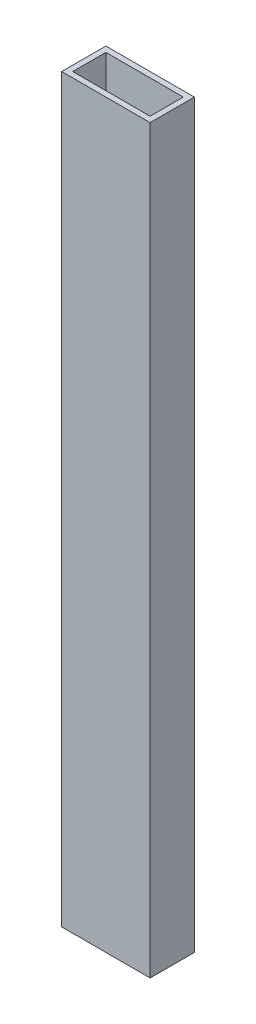
ISO-10303-21;
HEADER;
FILE_DESCRIPTION(('STEP AP214'),'2;1');
FILE_NAME('part.step','',(''),(''),'','','');
FILE_SCHEMA(('AUTOMOTIVE_DESIGN { 1 0 10303 214 1 1 1 1 }'));
ENDSEC;
DATA;
#1=APPLICATION_CONTEXT('core data for automotive mechanical design processes');
#2=APPLICATION_PROTOCOL_DEFINITION('international standard','automotive_design',2000,#1);
#3=PRODUCT_CONTEXT('',#1,'mechanical');
#4=PRODUCT('Part','Part','',(#3));
#5=PRODUCT_RELATED_PRODUCT_CATEGORY('part','',(#4));
#6=PRODUCT_DEFINITION_FORMATION('','',#4);
#7=PRODUCT_DEFINITION_CONTEXT('part definition',#1,'design');
#8=PRODUCT_DEFINITION('design','',#6,#7);
#9=PRODUCT_DEFINITION_SHAPE('','',#8);
#10=(LENGTH_UNIT() NAMED_UNIT(*) SI_UNIT(.MILLI.,.METRE.));
#11=(NAMED_UNIT(*) PLANE_ANGLE_UNIT() SI_UNIT($,.RADIAN.));
#12=(NAMED_UNIT(*) SI_UNIT($,.STERADIAN.) SOLID_ANGLE_UNIT());
#13=UNCERTAINTY_MEASURE_WITH_UNIT(LENGTH_MEASURE(1.E-05),#10,'distance_accuracy_value','');
#14=(GEOMETRIC_REPRESENTATION_CONTEXT(3) GLOBAL_UNCERTAINTY_ASSIGNED_CONTEXT((#13)) GLOBAL_UNIT_ASSIGNED_CONTEXT((#10,
#11,#12)) REPRESENTATION_CONTEXT('',''));
#15=CARTESIAN_POINT('',(0.,0.,0.));
#16=DIRECTION('',(0.,0.,1.));
#17=DIRECTION('',(1.,0.,0.));
#18=AXIS2_PLACEMENT_3D('',#15,#16,#17);
#19=CARTESIAN_POINT('',(0.,425.45,0.));
#20=DIRECTION('',(0.,-1.,0.));
#21=DIRECTION('',(0.,0.,-1.));
#22=AXIS2_PLACEMENT_3D('',#19,#20,#21);
#23=PLANE('',#22);
#24=DIRECTION('',(0.,0.,1.));
#25=VECTOR('',#24,1.);
#26=CARTESIAN_POINT('',(0.,425.45,0.));
#27=LINE('',#26,#25);
#28=CARTESIAN_POINT('',(0.,425.45,-25.4));
#29=VERTEX_POINT('',#28);
#30=CARTESIAN_POINT('',(0.,425.45,0.));
#31=VERTEX_POINT('',#30);
#32=EDGE_CURVE('E134',#29,#31,#27,.T.);
#33=ORIENTED_EDGE('',*,*,#32,.T.);
#34=DIRECTION('',(1.,0.,0.));
#35=VECTOR('',#34,1.);
#36=CARTESIAN_POINT('',(0.,425.45,0.));
#37=LINE('',#36,#35);
#38=CARTESIAN_POINT('',(50.8,425.45,0.));
#39=VERTEX_POINT('',#38);
#40=EDGE_CURVE('E137',#31,#39,#37,.T.);
#41=ORIENTED_EDGE('',*,*,#40,.T.);
#42=DIRECTION('',(0.,0.,-1.));
#43=VECTOR('',#42,1.);
#44=CARTESIAN_POINT('',(50.8,425.45,0.));
#45=LINE('',#44,#43);
#46=CARTESIAN_POINT('',(50.8,425.45,-25.4));
#47=VERTEX_POINT('',#46);
#48=EDGE_CURVE('E140',#39,#47,#45,.T.);
#49=ORIENTED_EDGE('',*,*,#48,.T.);
#50=DIRECTION('',(-1.,0.,0.));
#51=VECTOR('',#50,1.);
#52=CARTESIAN_POINT('',(0.,425.45,-25.4));
#53=LINE('',#52,#51);
#54=EDGE_CURVE('E142',#47,#29,#53,.T.);
#55=ORIENTED_EDGE('',*,*,#54,.T.);
#56=EDGE_LOOP('',(#33,#41,#49,#55));
#57=FACE_BOUND('',#56,.T.);
#58=DIRECTION('',(0.,0.,1.));
#59=VECTOR('',#58,1.);
#60=CARTESIAN_POINT('',(3.175,425.45,-22.225));
#61=LINE('',#60,#59);
#62=CARTESIAN_POINT('',(3.175,425.45,-22.225));
#63=VERTEX_POINT('',#62);
#64=CARTESIAN_POINT('',(3.175,425.45,-3.175));
#65=VERTEX_POINT('',#64);
#66=EDGE_CURVE('E98',#63,#65,#61,.T.);
#67=ORIENTED_EDGE('',*,*,#66,.F.);
#68=DIRECTION('',(-1.,0.,0.));
#69=VECTOR('',#68,1.);
#70=CARTESIAN_POINT('',(3.175,425.45,-22.225));
#71=LINE('',#70,#69);
#72=CARTESIAN_POINT('',(47.625,425.45,-22.225));
#73=VERTEX_POINT('',#72);
#74=EDGE_CURVE('E120',#73,#63,#71,.T.);
#75=ORIENTED_EDGE('',*,*,#74,.F.);
#76=DIRECTION('',(0.,0.,-1.));
#77=VECTOR('',#76,1.);
#78=CARTESIAN_POINT('',(47.625,425.45,-22.225));
#79=LINE('',#78,#77);
#80=CARTESIAN_POINT('',(47.625,425.45,-3.175));
#81=VERTEX_POINT('',#80);
#82=EDGE_CURVE('E118',#81,#73,#79,.T.);
#83=ORIENTED_EDGE('',*,*,#82,.F.);
#84=DIRECTION('',(1.,0.,0.));
#85=VECTOR('',#84,1.);
#86=CARTESIAN_POINT('',(3.175,425.45,-3.175));
#87=LINE('',#86,#85);
#88=EDGE_CURVE('E106',#65,#81,#87,.T.);
#89=ORIENTED_EDGE('',*,*,#88,.F.);
#90=EDGE_LOOP('',(#67,#75,#83,#89));
#91=FACE_BOUND('',#90,.T.);
#92=ADVANCED_FACE('F33',(#57,#91),#23,.F.);
#93=CARTESIAN_POINT('',(0.,0.,0.));
#94=DIRECTION('',(0.,-1.,0.));
#95=DIRECTION('',(0.,0.,-1.));
#96=AXIS2_PLACEMENT_3D('',#93,#94,#95);
#97=PLANE('',#96);
#98=DIRECTION('',(0.,0.,1.));
#99=VECTOR('',#98,1.);
#100=CARTESIAN_POINT('',(0.,0.,0.));
#101=LINE('',#100,#99);
#102=CARTESIAN_POINT('',(0.,0.,-25.4));
#103=VERTEX_POINT('',#102);
#104=CARTESIAN_POINT('',(0.,0.,0.));
#105=VERTEX_POINT('',#104);
#106=EDGE_CURVE('E114',#103,#105,#101,.T.);
#107=ORIENTED_EDGE('',*,*,#106,.F.);
#108=DIRECTION('',(-1.,0.,0.));
#109=VECTOR('',#108,1.);
#110=CARTESIAN_POINT('',(0.,0.,-25.4));
#111=LINE('',#110,#109);
#112=CARTESIAN_POINT('',(50.8,0.,-25.4));
#113=VERTEX_POINT('',#112);
#114=EDGE_CURVE('E138',#113,#103,#111,.T.);
#115=ORIENTED_EDGE('',*,*,#114,.F.);
#116=DIRECTION('',(0.,0.,-1.));
#117=VECTOR('',#116,1.);
#118=CARTESIAN_POINT('',(50.8,0.,0.));
#119=LINE('',#118,#117);
#120=CARTESIAN_POINT('',(50.8,0.,0.));
#121=VERTEX_POINT('',#120);
#122=EDGE_CURVE('E149',#121,#113,#119,.T.);
#123=ORIENTED_EDGE('',*,*,#122,.F.);
#124=DIRECTION('',(1.,0.,0.));
#125=VECTOR('',#124,1.);
#126=CARTESIAN_POINT('',(0.,0.,0.));
#127=LINE('',#126,#125);
#128=EDGE_CURVE('E147',#105,#121,#127,.T.);
#129=ORIENTED_EDGE('',*,*,#128,.F.);
#130=EDGE_LOOP('',(#107,#115,#123,#129));
#131=FACE_BOUND('',#130,.T.);
#132=DIRECTION('',(-1.,0.,0.));
#133=VECTOR('',#132,1.);
#134=CARTESIAN_POINT('',(3.175,0.,-22.225));
#135=LINE('',#134,#133);
#136=CARTESIAN_POINT('',(47.625,0.,-22.225));
#137=VERTEX_POINT('',#136);
#138=CARTESIAN_POINT('',(3.175,0.,-22.225));
#139=VERTEX_POINT('',#138);
#140=EDGE_CURVE('E107',#137,#139,#135,.T.);
#141=ORIENTED_EDGE('',*,*,#140,.T.);
#142=DIRECTION('',(0.,0.,1.));
#143=VECTOR('',#142,1.);
#144=CARTESIAN_POINT('',(3.175,0.,-22.225));
#145=LINE('',#144,#143);
#146=CARTESIAN_POINT('',(3.175,0.,-3.175));
#147=VERTEX_POINT('',#146);
#148=EDGE_CURVE('E56',#139,#147,#145,.T.);
#149=ORIENTED_EDGE('',*,*,#148,.T.);
#150=DIRECTION('',(1.,0.,0.));
#151=VECTOR('',#150,1.);
#152=CARTESIAN_POINT('',(3.175,0.,-3.175));
#153=LINE('',#152,#151);
#154=CARTESIAN_POINT('',(47.625,0.,-3.175));
#155=VERTEX_POINT('',#154);
#156=EDGE_CURVE('E113',#147,#155,#153,.T.);
#157=ORIENTED_EDGE('',*,*,#156,.T.);
#158=DIRECTION('',(0.,0.,-1.));
#159=VECTOR('',#158,1.);
#160=CARTESIAN_POINT('',(47.625,0.,-22.225));
#161=LINE('',#160,#159);
#162=EDGE_CURVE('E126',#155,#137,#161,.T.);
#163=ORIENTED_EDGE('',*,*,#162,.T.);
#164=EDGE_LOOP('',(#141,#149,#157,#163));
#165=FACE_BOUND('',#164,.T.);
#166=ADVANCED_FACE('F167',(#131,#165),#97,.T.);
#167=CARTESIAN_POINT('',(0.,425.45,0.));
#168=DIRECTION('',(1.,0.,0.));
#169=DIRECTION('',(0.,0.,-1.));
#170=AXIS2_PLACEMENT_3D('',#167,#168,#169);
#171=PLANE('',#170);
#172=ORIENTED_EDGE('',*,*,#106,.T.);
#173=DIRECTION('',(0.,-1.,0.));
#174=VECTOR('',#173,1.);
#175=CARTESIAN_POINT('',(0.,425.45,0.));
#176=LINE('',#175,#174);
#177=EDGE_CURVE('E11',#31,#105,#176,.T.);
#178=ORIENTED_EDGE('',*,*,#177,.F.);
#179=ORIENTED_EDGE('',*,*,#32,.F.);
#180=DIRECTION('',(0.,-1.,0.));
#181=VECTOR('',#180,1.);
#182=CARTESIAN_POINT('',(0.,425.45,-25.4));
#183=LINE('',#182,#181);
#184=EDGE_CURVE('E144',#29,#103,#183,.T.);
#185=ORIENTED_EDGE('',*,*,#184,.T.);
#186=EDGE_LOOP('',(#172,#178,#179,#185));
#187=FACE_BOUND('',#186,.T.);
#188=ADVANCED_FACE('F35',(#187),#171,.F.);
#189=CARTESIAN_POINT('',(0.,425.45,0.));
#190=DIRECTION('',(0.,0.,-1.));
#191=DIRECTION('',(-1.,0.,0.));
#192=AXIS2_PLACEMENT_3D('',#189,#190,#191);
#193=PLANE('',#192);
#194=ORIENTED_EDGE('',*,*,#128,.T.);
#195=DIRECTION('',(0.,-1.,0.));
#196=VECTOR('',#195,1.);
#197=CARTESIAN_POINT('',(50.8,425.45,0.));
#198=LINE('',#197,#196);
#199=EDGE_CURVE('E41',#39,#121,#198,.T.);
#200=ORIENTED_EDGE('',*,*,#199,.F.);
#201=ORIENTED_EDGE('',*,*,#40,.F.);
#202=ORIENTED_EDGE('',*,*,#177,.T.);
#203=EDGE_LOOP('',(#194,#200,#201,#202));
#204=FACE_BOUND('',#203,.T.);
#205=ADVANCED_FACE('F177',(#204),#193,.F.);
#206=CARTESIAN_POINT('',(50.8,425.45,0.));
#207=DIRECTION('',(-1.,0.,0.));
#208=DIRECTION('',(0.,0.,1.));
#209=AXIS2_PLACEMENT_3D('',#206,#207,#208);
#210=PLANE('',#209);
#211=ORIENTED_EDGE('',*,*,#122,.T.);
#212=DIRECTION('',(0.,-1.,0.));
#213=VECTOR('',#212,1.);
#214=CARTESIAN_POINT('',(50.8,425.45,-25.4));
#215=LINE('',#214,#213);
#216=EDGE_CURVE('E154',#47,#113,#215,.T.);
#217=ORIENTED_EDGE('',*,*,#216,.F.);
#218=ORIENTED_EDGE('',*,*,#48,.F.);
#219=ORIENTED_EDGE('',*,*,#199,.T.);
#220=EDGE_LOOP('',(#211,#217,#218,#219));
#221=FACE_BOUND('',#220,.T.);
#222=ADVANCED_FACE('F161',(#221),#210,.F.);
#223=CARTESIAN_POINT('',(0.,425.45,-25.4));
#224=DIRECTION('',(0.,0.,1.));
#225=DIRECTION('',(1.,0.,0.));
#226=AXIS2_PLACEMENT_3D('',#223,#224,#225);
#227=PLANE('',#226);
#228=ORIENTED_EDGE('',*,*,#114,.T.);
#229=ORIENTED_EDGE('',*,*,#184,.F.);
#230=ORIENTED_EDGE('',*,*,#54,.F.);
#231=ORIENTED_EDGE('',*,*,#216,.T.);
#232=EDGE_LOOP('',(#228,#229,#230,#231));
#233=FACE_BOUND('',#232,.T.);
#234=ADVANCED_FACE('F171',(#233),#227,.F.);
#235=CARTESIAN_POINT('',(3.175,425.45,-22.225));
#236=DIRECTION('',(1.,0.,0.));
#237=DIRECTION('',(0.,0.,-1.));
#238=AXIS2_PLACEMENT_3D('',#235,#236,#237);
#239=PLANE('',#238);
#240=ORIENTED_EDGE('',*,*,#148,.F.);
#241=DIRECTION('',(0.,-1.,0.));
#242=VECTOR('',#241,1.);
#243=CARTESIAN_POINT('',(3.175,425.45,-22.225));
#244=LINE('',#243,#242);
#245=EDGE_CURVE('E102',#63,#139,#244,.T.);
#246=ORIENTED_EDGE('',*,*,#245,.F.);
#247=ORIENTED_EDGE('',*,*,#66,.T.);
#248=DIRECTION('',(0.,-1.,0.));
#249=VECTOR('',#248,1.);
#250=CARTESIAN_POINT('',(3.175,425.45,-3.175));
#251=LINE('',#250,#249);
#252=EDGE_CURVE('E101',#65,#147,#251,.T.);
#253=ORIENTED_EDGE('',*,*,#252,.T.);
#254=EDGE_LOOP('',(#240,#246,#247,#253));
#255=FACE_BOUND('',#254,.T.);
#256=ADVANCED_FACE('F100',(#255),#239,.T.);
#257=CARTESIAN_POINT('',(3.175,425.45,-3.175));
#258=DIRECTION('',(0.,0.,-1.));
#259=DIRECTION('',(-1.,0.,0.));
#260=AXIS2_PLACEMENT_3D('',#257,#258,#259);
#261=PLANE('',#260);
#262=ORIENTED_EDGE('',*,*,#156,.F.);
#263=ORIENTED_EDGE('',*,*,#252,.F.);
#264=ORIENTED_EDGE('',*,*,#88,.T.);
#265=DIRECTION('',(0.,-1.,0.));
#266=VECTOR('',#265,1.);
#267=CARTESIAN_POINT('',(47.625,425.45,-3.175));
#268=LINE('',#267,#266);
#269=EDGE_CURVE('E115',#81,#155,#268,.T.);
#270=ORIENTED_EDGE('',*,*,#269,.T.);
#271=EDGE_LOOP('',(#262,#263,#264,#270));
#272=FACE_BOUND('',#271,.T.);
#273=ADVANCED_FACE('F110',(#272),#261,.T.);
#274=CARTESIAN_POINT('',(47.625,425.45,-22.225));
#275=DIRECTION('',(-1.,0.,0.));
#276=DIRECTION('',(0.,0.,1.));
#277=AXIS2_PLACEMENT_3D('',#274,#275,#276);
#278=PLANE('',#277);
#279=ORIENTED_EDGE('',*,*,#162,.F.);
#280=ORIENTED_EDGE('',*,*,#269,.F.);
#281=ORIENTED_EDGE('',*,*,#82,.T.);
#282=DIRECTION('',(0.,-1.,0.));
#283=VECTOR('',#282,1.);
#284=CARTESIAN_POINT('',(47.625,425.45,-22.225));
#285=LINE('',#284,#283);
#286=EDGE_CURVE('E48',#73,#137,#285,.T.);
#287=ORIENTED_EDGE('',*,*,#286,.T.);
#288=EDGE_LOOP('',(#279,#280,#281,#287));
#289=FACE_BOUND('',#288,.T.);
#290=ADVANCED_FACE('F200',(#289),#278,.T.);
#291=CARTESIAN_POINT('',(3.175,425.45,-22.225));
#292=DIRECTION('',(0.,0.,1.));
#293=DIRECTION('',(1.,0.,0.));
#294=AXIS2_PLACEMENT_3D('',#291,#292,#293);
#295=PLANE('',#294);
#296=ORIENTED_EDGE('',*,*,#140,.F.);
#297=ORIENTED_EDGE('',*,*,#286,.F.);
#298=ORIENTED_EDGE('',*,*,#74,.T.);
#299=ORIENTED_EDGE('',*,*,#245,.T.);
#300=EDGE_LOOP('',(#296,#297,#298,#299));
#301=FACE_BOUND('',#300,.T.);
#302=ADVANCED_FACE('F204',(#301),#295,.T.);
#303=CLOSED_SHELL('',(#92,#166,#188,#205,#222,#234,#256,#273,#290,#302));
#304=MANIFOLD_SOLID_BREP('B2',#303);
#305=ADVANCED_BREP_SHAPE_REPRESENTATION('',(#18,#304),#14);
#306=SHAPE_DEFINITION_REPRESENTATION(#9,#305);
ENDSEC;
END-ISO-10303-21;
